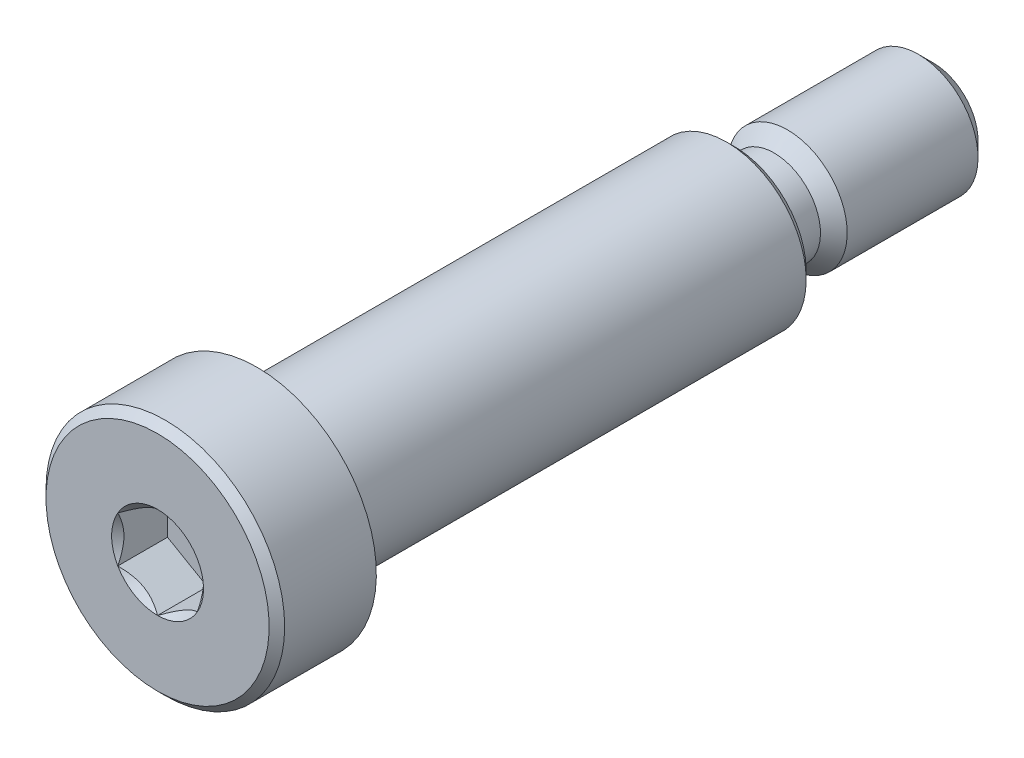
ISO-10303-21;
HEADER;
FILE_DESCRIPTION(('STEP AP214'),'2;1');
FILE_NAME('part.step','',(''),(''),'','','');
FILE_SCHEMA(('AUTOMOTIVE_DESIGN { 1 0 10303 214 1 1 1 1 }'));
ENDSEC;
DATA;
#1=APPLICATION_CONTEXT('core data for automotive mechanical design processes');
#2=APPLICATION_PROTOCOL_DEFINITION('international standard','automotive_design',2000,#1);
#3=PRODUCT_CONTEXT('',#1,'mechanical');
#4=PRODUCT('Part','Part','',(#3));
#5=PRODUCT_RELATED_PRODUCT_CATEGORY('part','',(#4));
#6=PRODUCT_DEFINITION_FORMATION('','',#4);
#7=PRODUCT_DEFINITION_CONTEXT('part definition',#1,'design');
#8=PRODUCT_DEFINITION('design','',#6,#7);
#9=PRODUCT_DEFINITION_SHAPE('','',#8);
#10=(LENGTH_UNIT() NAMED_UNIT(*) SI_UNIT(.MILLI.,.METRE.));
#11=(NAMED_UNIT(*) PLANE_ANGLE_UNIT() SI_UNIT($,.RADIAN.));
#12=(NAMED_UNIT(*) SI_UNIT($,.STERADIAN.) SOLID_ANGLE_UNIT());
#13=UNCERTAINTY_MEASURE_WITH_UNIT(LENGTH_MEASURE(1.E-05),#10,'distance_accuracy_value','');
#14=(GEOMETRIC_REPRESENTATION_CONTEXT(3) GLOBAL_UNCERTAINTY_ASSIGNED_CONTEXT((#13)) GLOBAL_UNIT_ASSIGNED_CONTEXT((#10,
#11,#12)) REPRESENTATION_CONTEXT('',''));
#15=CARTESIAN_POINT('',(0.,0.,0.));
#16=DIRECTION('',(0.,0.,1.));
#17=DIRECTION('',(1.,0.,0.));
#18=AXIS2_PLACEMENT_3D('',#15,#16,#17);
#19=CARTESIAN_POINT('',(0.,0.,0.));
#20=DIRECTION('',(0.,0.,1.));
#21=DIRECTION('',(0.,-1.,0.));
#22=AXIS2_PLACEMENT_3D('',#19,#20,#21);
#23=PLANE('',#22);
#24=CARTESIAN_POINT('',(0.,0.,0.));
#25=DIRECTION('',(0.,0.,1.));
#26=DIRECTION('',(1.,0.,0.));
#27=AXIS2_PLACEMENT_3D('',#24,#25,#26);
#28=CIRCLE('',#27,3.66617420935412);
#29=CARTESIAN_POINT('',(0.,-3.66617420935412,0.));
#30=VERTEX_POINT('',#29);
#31=CARTESIAN_POINT('',(3.175,-1.83308710467707,0.));
#32=VERTEX_POINT('',#31);
#33=EDGE_CURVE('E61',#30,#32,#28,.T.);
#34=ORIENTED_EDGE('',*,*,#33,.F.);
#35=CARTESIAN_POINT('',(-3.175,-1.83308710467706,0.));
#36=VERTEX_POINT('',#35);
#37=EDGE_CURVE('E68',#36,#30,#28,.T.);
#38=ORIENTED_EDGE('',*,*,#37,.F.);
#39=CARTESIAN_POINT('',(-3.175,1.83308710467706,0.));
#40=VERTEX_POINT('',#39);
#41=EDGE_CURVE('E141',#40,#36,#28,.T.);
#42=ORIENTED_EDGE('',*,*,#41,.F.);
#43=CARTESIAN_POINT('',(0.,3.66617420935412,0.));
#44=VERTEX_POINT('',#43);
#45=EDGE_CURVE('E136',#44,#40,#28,.T.);
#46=ORIENTED_EDGE('',*,*,#45,.F.);
#47=CARTESIAN_POINT('',(3.175,1.83308710467706,0.));
#48=VERTEX_POINT('',#47);
#49=EDGE_CURVE('E109',#48,#44,#28,.T.);
#50=ORIENTED_EDGE('',*,*,#49,.F.);
#51=EDGE_CURVE('E100',#32,#48,#28,.T.);
#52=ORIENTED_EDGE('',*,*,#51,.F.);
#53=EDGE_LOOP('',(#34,#38,#42,#46,#50,#52));
#54=FACE_BOUND('',#53,.T.);
#55=CARTESIAN_POINT('',(0.,0.,0.));
#56=DIRECTION('',(0.,0.,1.));
#57=DIRECTION('',(0.,-1.,0.));
#58=AXIS2_PLACEMENT_3D('',#55,#56,#57);
#59=CIRCLE('',#58,8.90587499999999);
#60=CARTESIAN_POINT('',(0.,-8.90587499999999,0.));
#61=VERTEX_POINT('',#60);
#62=EDGE_CURVE('E55',#61,#61,#59,.T.);
#63=ORIENTED_EDGE('',*,*,#62,.T.);
#64=EDGE_LOOP('',(#63));
#65=FACE_BOUND('',#64,.T.);
#66=ADVANCED_FACE('F41',(#54,#65),#23,.T.);
#67=CARTESIAN_POINT('',(0.,0.,-61.9125));
#68=DIRECTION('',(0.,0.,-1.));
#69=DIRECTION('',(0.,1.,0.));
#70=AXIS2_PLACEMENT_3D('',#67,#68,#69);
#71=CYLINDRICAL_SURFACE('',#70,9.525);
#72=CARTESIAN_POINT('',(0.,0.,-0.619125000000019));
#73=DIRECTION('',(0.,0.,1.));
#74=DIRECTION('',(0.,-1.,0.));
#75=AXIS2_PLACEMENT_3D('',#72,#73,#74);
#76=CIRCLE('',#75,9.525);
#77=CARTESIAN_POINT('',(0.,-9.525,-0.619125000000019));
#78=VERTEX_POINT('',#77);
#79=EDGE_CURVE('E236',#78,#78,#76,.F.);
#80=ORIENTED_EDGE('',*,*,#79,.T.);
#81=EDGE_LOOP('',(#80));
#82=FACE_BOUND('',#81,.T.);
#83=CARTESIAN_POINT('',(0.,0.,-7.93750000000001));
#84=DIRECTION('',(0.,0.,-1.));
#85=DIRECTION('',(0.,1.,0.));
#86=AXIS2_PLACEMENT_3D('',#83,#84,#85);
#87=CIRCLE('',#86,9.525);
#88=CARTESIAN_POINT('',(0.,9.525,-7.93750000000001));
#89=VERTEX_POINT('',#88);
#90=EDGE_CURVE('E251',#89,#89,#87,.T.);
#91=ORIENTED_EDGE('',*,*,#90,.F.);
#92=EDGE_LOOP('',(#91));
#93=FACE_BOUND('',#92,.T.);
#94=ADVANCED_FACE('F202',(#82,#93),#71,.T.);
#95=CARTESIAN_POINT('',(0.,-9.525,-7.93750000000001));
#96=DIRECTION('',(0.,0.,-1.));
#97=DIRECTION('',(0.,1.,0.));
#98=AXIS2_PLACEMENT_3D('',#95,#96,#97);
#99=PLANE('',#98);
#100=ORIENTED_EDGE('',*,*,#90,.T.);
#101=EDGE_LOOP('',(#100));
#102=FACE_BOUND('',#101,.T.);
#103=CARTESIAN_POINT('',(0.,0.,-7.93750000000001));
#104=DIRECTION('',(0.,0.,-1.));
#105=DIRECTION('',(0.,1.,0.));
#106=AXIS2_PLACEMENT_3D('',#103,#104,#105);
#107=CIRCLE('',#106,6.34999999999999);
#108=CARTESIAN_POINT('',(0.,6.34999999999999,-7.93750000000001));
#109=VERTEX_POINT('',#108);
#110=EDGE_CURVE('E253',#109,#109,#107,.T.);
#111=ORIENTED_EDGE('',*,*,#110,.F.);
#112=EDGE_LOOP('',(#111));
#113=FACE_BOUND('',#112,.T.);
#114=ADVANCED_FACE('F209',(#102,#113),#99,.T.);
#115=CARTESIAN_POINT('',(0.,0.,-61.9125));
#116=DIRECTION('',(0.,0.,-1.));
#117=DIRECTION('',(0.,1.,0.));
#118=AXIS2_PLACEMENT_3D('',#115,#116,#117);
#119=CYLINDRICAL_SURFACE('',#118,6.35);
#120=CARTESIAN_POINT('',(0.,0.,-45.418375));
#121=DIRECTION('',(0.,0.,-1.));
#122=DIRECTION('',(0.,1.,0.));
#123=AXIS2_PLACEMENT_3D('',#120,#121,#122);
#124=CIRCLE('',#123,6.35);
#125=CARTESIAN_POINT('',(0.,-6.34999999999999,-45.418375));
#126=VERTEX_POINT('',#125);
#127=EDGE_CURVE('E229',#126,#126,#124,.F.);
#128=ORIENTED_EDGE('',*,*,#127,.T.);
#129=EDGE_LOOP('',(#128));
#130=FACE_BOUND('',#129,.T.);
#131=ORIENTED_EDGE('',*,*,#110,.T.);
#132=EDGE_LOOP('',(#131));
#133=FACE_BOUND('',#132,.T.);
#134=ADVANCED_FACE('F418',(#130,#133),#119,.T.);
#135=CARTESIAN_POINT('',(0.,-6.35,-46.0375));
#136=DIRECTION('',(0.,0.,-1.));
#137=DIRECTION('',(0.,1.,0.));
#138=AXIS2_PLACEMENT_3D('',#135,#136,#137);
#139=PLANE('',#138);
#140=CARTESIAN_POINT('',(0.,0.,-46.0375));
#141=DIRECTION('',(0.,0.,-1.));
#142=DIRECTION('',(0.,1.,0.));
#143=AXIS2_PLACEMENT_3D('',#140,#141,#142);
#144=CIRCLE('',#143,5.73087499999999);
#145=CARTESIAN_POINT('',(0.,-5.73087499999998,-46.0375));
#146=VERTEX_POINT('',#145);
#147=EDGE_CURVE('E232',#146,#146,#144,.T.);
#148=ORIENTED_EDGE('',*,*,#147,.T.);
#149=EDGE_LOOP('',(#148));
#150=FACE_BOUND('',#149,.T.);
#151=CARTESIAN_POINT('',(0.,0.,-46.0375));
#152=DIRECTION('',(0.,0.,-1.));
#153=DIRECTION('',(0.,1.,0.));
#154=AXIS2_PLACEMENT_3D('',#151,#152,#153);
#155=CIRCLE('',#154,4.7625);
#156=CARTESIAN_POINT('',(0.,4.7625,-46.0375));
#157=VERTEX_POINT('',#156);
#158=EDGE_CURVE('E262',#157,#157,#155,.T.);
#159=ORIENTED_EDGE('',*,*,#158,.F.);
#160=EDGE_LOOP('',(#159));
#161=FACE_BOUND('',#160,.T.);
#162=ADVANCED_FACE('F398',(#150,#161),#139,.T.);
#163=CARTESIAN_POINT('',(0.,0.,-47.1043));
#164=DIRECTION('',(0.,0.,-1.));
#165=DIRECTION('',(0.,1.,0.));
#166=AXIS2_PLACEMENT_3D('',#163,#164,#165);
#167=TOROIDAL_SURFACE('',#166,4.7625,1.0668);
#168=CARTESIAN_POINT('',(0.,0.,-47.1043));
#169=DIRECTION('',(0.,0.,-1.));
#170=DIRECTION('',(0.,1.,0.));
#171=AXIS2_PLACEMENT_3D('',#168,#169,#170);
#172=CIRCLE('',#171,3.6957);
#173=CARTESIAN_POINT('',(0.,3.6957,-47.1043));
#174=VERTEX_POINT('',#173);
#175=EDGE_CURVE('E266',#174,#174,#172,.T.);
#176=ORIENTED_EDGE('',*,*,#175,.F.);
#177=EDGE_LOOP('',(#176));
#178=FACE_BOUND('',#177,.T.);
#179=ORIENTED_EDGE('',*,*,#158,.T.);
#180=EDGE_LOOP('',(#179));
#181=FACE_BOUND('',#180,.T.);
#182=ADVANCED_FACE('F390',(#178,#181),#167,.F.);
#183=CARTESIAN_POINT('',(0.,0.,-61.9125));
#184=DIRECTION('',(0.,0.,-1.));
#185=DIRECTION('',(0.,1.,0.));
#186=AXIS2_PLACEMENT_3D('',#183,#184,#185);
#187=CYLINDRICAL_SURFACE('',#186,3.6957);
#188=CARTESIAN_POINT('',(0.,0.,-49.2125));
#189=DIRECTION('',(0.,0.,-1.));
#190=DIRECTION('',(0.,1.,0.));
#191=AXIS2_PLACEMENT_3D('',#188,#189,#190);
#192=CIRCLE('',#191,3.6957);
#193=CARTESIAN_POINT('',(0.,3.6957,-49.2125));
#194=VERTEX_POINT('',#193);
#195=EDGE_CURVE('E270',#194,#194,#192,.T.);
#196=ORIENTED_EDGE('',*,*,#195,.F.);
#197=EDGE_LOOP('',(#196));
#198=FACE_BOUND('',#197,.T.);
#199=ORIENTED_EDGE('',*,*,#175,.T.);
#200=EDGE_LOOP('',(#199));
#201=FACE_BOUND('',#200,.T.);
#202=ADVANCED_FACE('F382',(#198,#201),#187,.T.);
#203=CARTESIAN_POINT('',(0.,0.,-49.2125));
#204=DIRECTION('',(0.,0.,-1.));
#205=DIRECTION('',(0.,1.,0.));
#206=AXIS2_PLACEMENT_3D('',#203,#204,#205);
#207=CONICAL_SURFACE('',#206,3.6957,0.785398163397443);
#208=CARTESIAN_POINT('',(0.,0.,-50.2793));
#209=DIRECTION('',(0.,0.,-1.));
#210=DIRECTION('',(0.,1.,0.));
#211=AXIS2_PLACEMENT_3D('',#208,#209,#210);
#212=CIRCLE('',#211,4.7625);
#213=CARTESIAN_POINT('',(0.,4.7625,-50.2793));
#214=VERTEX_POINT('',#213);
#215=EDGE_CURVE('E257',#214,#214,#212,.F.);
#216=ORIENTED_EDGE('',*,*,#215,.T.);
#217=EDGE_LOOP('',(#216));
#218=FACE_BOUND('',#217,.T.);
#219=ORIENTED_EDGE('',*,*,#195,.T.);
#220=EDGE_LOOP('',(#219));
#221=FACE_BOUND('',#220,.T.);
#222=ADVANCED_FACE('F376',(#218,#221),#207,.T.);
#223=CARTESIAN_POINT('',(0.,-4.7625,-61.9125));
#224=DIRECTION('',(0.,0.,-1.));
#225=DIRECTION('',(0.,1.,0.));
#226=AXIS2_PLACEMENT_3D('',#223,#224,#225);
#227=PLANE('',#226);
#228=CARTESIAN_POINT('',(0.,0.,-61.9125));
#229=DIRECTION('',(0.,0.,-1.));
#230=DIRECTION('',(0.,1.,0.));
#231=AXIS2_PLACEMENT_3D('',#228,#229,#230);
#232=CIRCLE('',#231,3.57187500000002);
#233=CARTESIAN_POINT('',(0.,3.57187500000002,-61.9125));
#234=VERTEX_POINT('',#233);
#235=EDGE_CURVE('E239',#234,#234,#232,.T.);
#236=ORIENTED_EDGE('',*,*,#235,.T.);
#237=EDGE_LOOP('',(#236));
#238=FACE_BOUND('',#237,.T.);
#239=ADVANCED_FACE('F381',(#238),#227,.T.);
#240=CARTESIAN_POINT('',(0.,0.,-61.9125));
#241=DIRECTION('',(0.,0.,-1.));
#242=DIRECTION('',(0.,1.,0.));
#243=AXIS2_PLACEMENT_3D('',#240,#241,#242);
#244=CYLINDRICAL_SURFACE('',#243,4.7625);
#245=CARTESIAN_POINT('',(0.,0.,-60.721875));
#246=DIRECTION('',(0.,0.,-1.));
#247=DIRECTION('',(0.,1.,0.));
#248=AXIS2_PLACEMENT_3D('',#245,#246,#247);
#249=CIRCLE('',#248,4.7625);
#250=CARTESIAN_POINT('',(0.,4.7625,-60.721875));
#251=VERTEX_POINT('',#250);
#252=EDGE_CURVE('E234',#251,#251,#249,.F.);
#253=ORIENTED_EDGE('',*,*,#252,.T.);
#254=EDGE_LOOP('',(#253));
#255=FACE_BOUND('',#254,.T.);
#256=ORIENTED_EDGE('',*,*,#215,.F.);
#257=EDGE_LOOP('',(#256));
#258=FACE_BOUND('',#257,.T.);
#259=ADVANCED_FACE('F217',(#255,#258),#244,.T.);
#260=CARTESIAN_POINT('',(0.,0.,-61.9125));
#261=DIRECTION('',(0.,0.,1.));
#262=DIRECTION('',(0.,-1.,0.));
#263=AXIS2_PLACEMENT_3D('',#260,#261,#262);
#264=CONICAL_SURFACE('',#263,3.57187500000002,0.785398163397442);
#265=ORIENTED_EDGE('',*,*,#252,.F.);
#266=EDGE_LOOP('',(#265));
#267=FACE_BOUND('',#266,.T.);
#268=ORIENTED_EDGE('',*,*,#235,.F.);
#269=EDGE_LOOP('',(#268));
#270=FACE_BOUND('',#269,.T.);
#271=ADVANCED_FACE('F214',(#267,#270),#264,.T.);
#272=CARTESIAN_POINT('',(0.,0.,-46.0375));
#273=DIRECTION('',(0.,0.,1.));
#274=DIRECTION('',(0.,-1.,0.));
#275=AXIS2_PLACEMENT_3D('',#272,#273,#274);
#276=CONICAL_SURFACE('',#275,5.73087499999999,0.78539816339745);
#277=CARTESIAN_POINT('',(0.,-6.34999999999999,-45.418375));
#278=CARTESIAN_POINT('',(0.,-6.34355078124999,-45.42482421875));
#279=CARTESIAN_POINT('',(0.,-6.33710156249999,-45.4312734375));
#280=CARTESIAN_POINT('',(0.,-6.32420312499999,-45.444171875));
#281=CARTESIAN_POINT('',(0.,-6.31775390624999,-45.45062109375));
#282=CARTESIAN_POINT('',(0.,-6.30485546874999,-45.46351953125));
#283=CARTESIAN_POINT('',(0.,-6.29840624999999,-45.46996875));
#284=CARTESIAN_POINT('',(0.,-6.28550781249999,-45.4828671875));
#285=CARTESIAN_POINT('',(0.,-6.27905859374999,-45.48931640625));
#286=CARTESIAN_POINT('',(0.,-6.26616015624999,-45.50221484375));
#287=CARTESIAN_POINT('',(0.,-6.25971093749999,-45.5086640625));
#288=CARTESIAN_POINT('',(0.,-6.24681249999999,-45.5215625));
#289=CARTESIAN_POINT('',(0.,-6.24036328124999,-45.52801171875));
#290=CARTESIAN_POINT('',(0.,-6.22746484374999,-45.54091015625));
#291=CARTESIAN_POINT('',(0.,-6.22101562499999,-45.547359375));
#292=CARTESIAN_POINT('',(0.,-6.20811718749999,-45.5602578125));
#293=CARTESIAN_POINT('',(0.,-6.20166796874999,-45.56670703125));
#294=CARTESIAN_POINT('',(0.,-6.18876953124999,-45.57960546875));
#295=CARTESIAN_POINT('',(0.,-6.18232031249999,-45.5860546875));
#296=CARTESIAN_POINT('',(0.,-6.16942187499999,-45.598953125));
#297=CARTESIAN_POINT('',(0.,-6.16297265624999,-45.60540234375));
#298=CARTESIAN_POINT('',(0.,-6.15007421874999,-45.61830078125));
#299=CARTESIAN_POINT('',(0.,-6.14362499999999,-45.62475));
#300=CARTESIAN_POINT('',(0.,-6.13072656249999,-45.6376484375));
#301=CARTESIAN_POINT('',(0.,-6.12427734374999,-45.64409765625));
#302=CARTESIAN_POINT('',(0.,-6.11137890624999,-45.65699609375));
#303=CARTESIAN_POINT('',(0.,-6.10492968749999,-45.6634453125));
#304=CARTESIAN_POINT('',(0.,-6.09203124999999,-45.67634375));
#305=CARTESIAN_POINT('',(0.,-6.08558203124999,-45.68279296875));
#306=CARTESIAN_POINT('',(0.,-6.07268359374999,-45.69569140625));
#307=CARTESIAN_POINT('',(0.,-6.06623437499999,-45.702140625));
#308=CARTESIAN_POINT('',(0.,-6.05333593749999,-45.7150390625));
#309=CARTESIAN_POINT('',(0.,-6.04688671874999,-45.72148828125));
#310=CARTESIAN_POINT('',(0.,-6.03398828124999,-45.73438671875));
#311=CARTESIAN_POINT('',(0.,-6.02753906249999,-45.7408359375));
#312=CARTESIAN_POINT('',(0.,-6.01464062499999,-45.753734375));
#313=CARTESIAN_POINT('',(0.,-6.00819140624999,-45.76018359375));
#314=CARTESIAN_POINT('',(0.,-5.99529296874999,-45.77308203125));
#315=CARTESIAN_POINT('',(0.,-5.98884374999998,-45.77953125));
#316=CARTESIAN_POINT('',(0.,-5.97594531249998,-45.7924296875));
#317=CARTESIAN_POINT('',(0.,-5.96949609374999,-45.79887890625));
#318=CARTESIAN_POINT('',(0.,-5.95659765624999,-45.81177734375));
#319=CARTESIAN_POINT('',(0.,-5.95014843749999,-45.8182265625));
#320=CARTESIAN_POINT('',(0.,-5.93724999999999,-45.831125));
#321=CARTESIAN_POINT('',(0.,-5.93080078124999,-45.83757421875));
#322=CARTESIAN_POINT('',(0.,-5.91790234374998,-45.85047265625));
#323=CARTESIAN_POINT('',(0.,-5.91145312499998,-45.856921875));
#324=CARTESIAN_POINT('',(0.,-5.89855468749998,-45.8698203125));
#325=CARTESIAN_POINT('',(0.,-5.89210546874998,-45.87626953125));
#326=CARTESIAN_POINT('',(0.,-5.87920703124998,-45.88916796875));
#327=CARTESIAN_POINT('',(0.,-5.87275781249998,-45.8956171875));
#328=CARTESIAN_POINT('',(0.,-5.85985937499998,-45.908515625));
#329=CARTESIAN_POINT('',(0.,-5.85341015624998,-45.91496484375));
#330=CARTESIAN_POINT('',(0.,-5.84051171874998,-45.92786328125));
#331=CARTESIAN_POINT('',(0.,-5.83406249999998,-45.9343125));
#332=CARTESIAN_POINT('',(0.,-5.82116406249998,-45.9472109375));
#333=CARTESIAN_POINT('',(0.,-5.81471484374998,-45.95366015625));
#334=CARTESIAN_POINT('',(0.,-5.80181640624998,-45.96655859375));
#335=CARTESIAN_POINT('',(0.,-5.79536718749998,-45.9730078125));
#336=CARTESIAN_POINT('',(0.,-5.78246874999998,-45.98590625));
#337=CARTESIAN_POINT('',(0.,-5.77601953124998,-45.99235546875));
#338=CARTESIAN_POINT('',(0.,-5.76312109374998,-46.00525390625));
#339=CARTESIAN_POINT('',(0.,-5.75667187499998,-46.011703125));
#340=CARTESIAN_POINT('',(0.,-5.74377343749998,-46.0246015625));
#341=CARTESIAN_POINT('',(0.,-5.73732421874998,-46.03105078125));
#342=CARTESIAN_POINT('',(0.,-5.73087499999998,-46.0375));
#343=B_SPLINE_CURVE_WITH_KNOTS('',3,(#277,#278,#279,#280,#281,#282,#283,#284,#285,#286,#287,
#288,#289,#290,#291,#292,#293,#294,#295,#296,#297,#298,#299,#300,#301,#302,#303,#304,#305,#306,
#307,#308,#309,#310,#311,#312,#313,#314,#315,#316,#317,#318,#319,#320,#321,#322,#323,#324,#325,
#326,#327,#328,#329,#330,#331,#332,#333,#334,#335,#336,#337,#338,#339,#340,#341,#342),
.UNSPECIFIED.,.F.,.F.,(4,2,2,2,2,2,2,2,2,2,2,2,2,2,2,2,2,2,2,2,2,2,2,2,2,2,2,2,2,2,2,2,4),(0.,
0.0273617178688837,0.0547234357377674,0.0820851536066518,0.109446871475536,0.136808589344414,
0.164170307213299,0.191532025082182,0.218893742951066,0.24625546081995,0.273617178688829,
0.300978896557713,0.328340614426597,0.355702332295481,0.38306405016436,0.410425768033244,
0.437787485902128,0.465149203771012,0.492510921639895,0.519872639508775,0.547234357377659,
0.574596075246542,0.601957793115427,0.629319510984305,0.656681228853189,0.684042946722074,
0.711404664590957,0.738766382459841,0.76612810032872,0.793489818197604,0.820851536066488,
0.848213253935372,0.875574971804251),.UNSPECIFIED.);
#344=EDGE_CURVE('BSEAM216',#126,#146,#343,.T.);
#345=ORIENTED_EDGE('',*,*,#127,.F.);
#346=ORIENTED_EDGE('',*,*,#147,.F.);
#347=ORIENTED_EDGE('',*,*,#344,.T.);
#348=ORIENTED_EDGE('',*,*,#344,.F.);
#349=EDGE_LOOP('',(#345,#347,#346,#348));
#350=FACE_BOUND('',#349,.T.);
#351=ADVANCED_FACE('F216',(#350),#276,.T.);
#352=CARTESIAN_POINT('',(0.,0.,-0.619125000000019));
#353=DIRECTION('',(0.,0.,-1.));
#354=DIRECTION('',(0.,1.,0.));
#355=AXIS2_PLACEMENT_3D('',#352,#353,#354);
#356=CONICAL_SURFACE('',#355,9.525,0.785398163397443);
#357=ORIENTED_EDGE('',*,*,#62,.F.);
#358=EDGE_LOOP('',(#357));
#359=FACE_BOUND('',#358,.T.);
#360=ORIENTED_EDGE('',*,*,#79,.F.);
#361=EDGE_LOOP('',(#360));
#362=FACE_BOUND('',#361,.T.);
#363=ADVANCED_FACE('F43',(#359,#362),#356,.T.);
#364=CARTESIAN_POINT('',(0.,0.,0.));
#365=DIRECTION('',(0.,0.,1.));
#366=DIRECTION('',(1.,0.,0.));
#367=AXIS2_PLACEMENT_3D('',#364,#365,#366);
#368=CONICAL_SURFACE('',#367,3.66617420935412,0.78539816339745);
#369=ORIENTED_EDGE('',*,*,#49,.T.);
#370=CARTESIAN_POINT('',(3.1752,1.83297163462322,0.000115475508944067));
#371=CARTESIAN_POINT('',(3.06606165005017,1.89598269034567,-0.0628410163082169));
#372=CARTESIAN_POINT('',(2.95509837192206,1.9600473688431,-0.122099895765255));
#373=CARTESIAN_POINT('',(2.72883215365405,2.09068223086865,-0.230601344269443));
#374=CARTESIAN_POINT('',(2.61350769674774,2.15726483710766,-0.279783546061288));
#375=CARTESIAN_POINT('',(2.38096147751938,2.29152545937818,-0.364033541125997));
#376=CARTESIAN_POINT('',(2.26379893371885,2.35916928558036,-0.399313085500551));
#377=CARTESIAN_POINT('',(2.02689455535372,2.49594609220167,-0.45366842986518));
#378=CARTESIAN_POINT('',(1.90715995735645,2.5650748945867,-0.47278480247036));
#379=CARTESIAN_POINT('',(1.70080208124842,2.68421566990707,-0.490032869376752));
#380=CARTESIAN_POINT('',(1.61444529227085,2.73407378526963,-0.492586066386179));
#381=CARTESIAN_POINT('',(1.44187218347529,2.83370891608763,-0.488283726876735));
#382=CARTESIAN_POINT('',(1.3556559235072,2.88348589698873,-0.481424891978556));
#383=CARTESIAN_POINT('',(1.18404020841287,2.98256827629561,-0.4586901166963));
#384=CARTESIAN_POINT('',(1.09864177574673,3.03187308438378,-0.442804090312722));
#385=CARTESIAN_POINT('',(0.929311596694528,3.1296359088415,-0.402882016002049));
#386=CARTESIAN_POINT('',(0.845379738380253,3.17809398983283,-0.37884659291483));
#387=CARTESIAN_POINT('',(0.696376420715886,3.2641210953965,-0.329394765582835));
#388=CARTESIAN_POINT('',(0.630975148808269,3.30188053733771,-0.305278280699013));
#389=CARTESIAN_POINT('',(0.501346749794894,3.3767215284027,-0.253158532862845));
#390=CARTESIAN_POINT('',(0.437119658558277,3.41380305681743,-0.225155151396475));
#391=CARTESIAN_POINT('',(0.3100419654874,3.48717139711989,-0.165889434455491));
#392=CARTESIAN_POINT('',(0.247187749251276,3.52346029578352,-0.134637346645791));
#393=CARTESIAN_POINT('',(0.122643379151907,3.59536602138644,-0.0692846556080675));
#394=CARTESIAN_POINT('',(0.0609525390212909,3.63098324454239,-0.0351858004814551));
#395=CARTESIAN_POINT('',(-0.000199999999999575,3.66628967940796,0.000115475508943787));
#396=B_SPLINE_CURVE_WITH_KNOTS('',3,(#370,#371,#372,#373,#374,#375,#376,#377,#378,#379,#380,
#381,#382,#383,#384,#385,#386,#387,#388,#389,#390,#391,#392,#393,#394,#395),.UNSPECIFIED.,.F.,
.F.,(4,2,2,2,2,2,2,2,2,2,2,2,4),(0.,0.422910572436808,0.848285055427807,1.26690402276127,
1.68446903107506,1.98329272958351,2.2822211754689,2.58148426995465,2.88072442418452,
3.11844134429546,3.35616551414405,3.59316134346767,3.8300126974443),.UNSPECIFIED.);
#397=EDGE_CURVE('E11',#48,#44,#396,.T.);
#398=ORIENTED_EDGE('',*,*,#397,.F.);
#399=EDGE_LOOP('',(#369,#398));
#400=FACE_BOUND('',#399,.T.);
#401=ADVANCED_FACE('F112',(#400),#368,.F.);
#402=ORIENTED_EDGE('',*,*,#45,.T.);
#403=CARTESIAN_POINT('',(0.000200000000000467,3.66628967940796,0.000115475508943935));
#404=CARTESIAN_POINT('',(-0.108938349949825,3.60327862368552,-0.0628410163082174));
#405=CARTESIAN_POINT('',(-0.219901628077944,3.53921394518809,-0.122099895765256));
#406=CARTESIAN_POINT('',(-0.446167846345946,3.40857908316254,-0.230601344269443));
#407=CARTESIAN_POINT('',(-0.561492303252261,3.34199647692353,-0.279783546061287));
#408=CARTESIAN_POINT('',(-0.794038522480624,3.207735854653,-0.364033541125996));
#409=CARTESIAN_POINT('',(-0.911201066281148,3.14009202845083,-0.39931308550055));
#410=CARTESIAN_POINT('',(-1.14810544464628,3.00331522182952,-0.453668429865179));
#411=CARTESIAN_POINT('',(-1.26784004264355,2.93418641944448,-0.47278480247036));
#412=CARTESIAN_POINT('',(-1.47419791875158,2.81504564412411,-0.490032869376752));
#413=CARTESIAN_POINT('',(-1.56055470772915,2.76518752876156,-0.492586066386179));
#414=CARTESIAN_POINT('',(-1.73312781652471,2.66555239794355,-0.488283726876735));
#415=CARTESIAN_POINT('',(-1.8193440764928,2.61577541704245,-0.481424891978555));
#416=CARTESIAN_POINT('',(-1.99095979158713,2.51669303773558,-0.458690116696299));
#417=CARTESIAN_POINT('',(-2.07635822425327,2.4673882296474,-0.442804090312722));
#418=CARTESIAN_POINT('',(-2.24568840330547,2.36962540518969,-0.402882016002048));
#419=CARTESIAN_POINT('',(-2.32962026161975,2.32116732419836,-0.37884659291483));
#420=CARTESIAN_POINT('',(-2.47862357928411,2.23514021863469,-0.329394765582835));
#421=CARTESIAN_POINT('',(-2.54402485119173,2.19738077669348,-0.305278280699012));
#422=CARTESIAN_POINT('',(-2.67365325020511,2.12253978562849,-0.253158532862845));
#423=CARTESIAN_POINT('',(-2.73788034144172,2.08545825721376,-0.225155151396475));
#424=CARTESIAN_POINT('',(-2.8649580345126,2.01208991691129,-0.165889434455491));
#425=CARTESIAN_POINT('',(-2.92781225074872,1.97580101824767,-0.134637346645791));
#426=CARTESIAN_POINT('',(-3.05235662084809,1.90389529264474,-0.0692846556080678));
#427=CARTESIAN_POINT('',(-3.11404746097871,1.8682780694888,-0.0351858004814554));
#428=CARTESIAN_POINT('',(-3.1752,1.83297163462323,0.000115475508943606));
#429=B_SPLINE_CURVE_WITH_KNOTS('',3,(#403,#404,#405,#406,#407,#408,#409,#410,#411,#412,#413,
#414,#415,#416,#417,#418,#419,#420,#421,#422,#423,#424,#425,#426,#427,#428),.UNSPECIFIED.,.F.,
.F.,(4,2,2,2,2,2,2,2,2,2,2,2,4),(0.,0.422910572436808,0.848285055427807,1.26690402276127,
1.68446903107506,1.98329272958351,2.2822211754689,2.58148426995465,2.88072442418451,
3.11844134429546,3.35616551414405,3.59316134346766,3.8300126974443),.UNSPECIFIED.);
#430=EDGE_CURVE('E137',#44,#40,#429,.T.);
#431=ORIENTED_EDGE('',*,*,#430,.F.);
#432=EDGE_LOOP('',(#402,#431));
#433=FACE_BOUND('',#432,.T.);
#434=ADVANCED_FACE('F307',(#433),#368,.F.);
#435=ORIENTED_EDGE('',*,*,#41,.T.);
#436=CARTESIAN_POINT('',(-3.175,-3.65592387452516,1.17597452610651));
#437=CARTESIAN_POINT('',(-3.175,-3.56690614739902,1.10877955728795));
#438=CARTESIAN_POINT('',(-3.175,-3.47739001482927,1.04223411677949));
#439=CARTESIAN_POINT('',(-3.175,-3.29716433407819,0.910733107989));
#440=CARTESIAN_POINT('',(-3.175,-3.20645449195236,0.8457779430093));
#441=CARTESIAN_POINT('',(-3.175,-3.02298124672425,0.717286472588262));
#442=CARTESIAN_POINT('',(-3.175,-2.93020737789476,0.653765060519482));
#443=CARTESIAN_POINT('',(-3.175,-2.74308490461527,0.529093231239513));
#444=CARTESIAN_POINT('',(-3.175,-2.64873641209623,0.467942646518007));
#445=CARTESIAN_POINT('',(-3.175,-2.45276910629102,0.345127291468585));
#446=CARTESIAN_POINT('',(-3.175,-2.35104296923552,0.283632900035067));
#447=CARTESIAN_POINT('',(-3.175,-2.14521620329061,0.164690024110211));
#448=CARTESIAN_POINT('',(-3.175,-2.04111520164361,0.107242180628362));
#449=CARTESIAN_POINT('',(-3.175,-1.8305483898592,-0.00236807378855735));
#450=CARTESIAN_POINT('',(-3.175,-1.72409073387149,-0.05454602658689));
#451=CARTESIAN_POINT('',(-3.175,-1.50827203793058,-0.152448430174923));
#452=CARTESIAN_POINT('',(-3.175,-1.39891233941784,-0.198175803007057));
#453=CARTESIAN_POINT('',(-3.175,-1.18604701054559,-0.278193824629251));
#454=CARTESIAN_POINT('',(-3.175,-1.08277848917347,-0.313108695034414));
#455=CARTESIAN_POINT('',(-3.175,-0.873755153890324,-0.374653665073786));
#456=CARTESIAN_POINT('',(-3.175,-0.768000169236097,-0.401283193963396));
#457=CARTESIAN_POINT('',(-3.175,-0.556394353071963,-0.444423804951883));
#458=CARTESIAN_POINT('',(-3.175,-0.450579451492892,-0.461108250420231));
#459=CARTESIAN_POINT('',(-3.175,-0.237818454981045,-0.484034858218018));
#460=CARTESIAN_POINT('',(-3.175,-0.130872557680108,-0.49027881555587));
#461=CARTESIAN_POINT('',(-3.175,0.0792250150830045,-0.491860727197653));
#462=CARTESIAN_POINT('',(-3.175,0.18237391199382,-0.487585251998013));
#463=CARTESIAN_POINT('',(-3.175,0.387788153537299,-0.469217325011947));
#464=CARTESIAN_POINT('',(-3.175,0.490053411359905,-0.455123919552885));
#465=CARTESIAN_POINT('',(-3.175,0.694689208906974,-0.417649304806497));
#466=CARTESIAN_POINT('',(-3.175,0.797030337701614,-0.394110040645698));
#467=CARTESIAN_POINT('',(-3.175,0.999482692253839,-0.3389990990408));
#468=CARTESIAN_POINT('',(-3.175,1.09959410383402,-0.307428093699382));
#469=CARTESIAN_POINT('',(-3.175,1.30666025401972,-0.234302973381313));
#470=CARTESIAN_POINT('',(-3.175,1.41338058113121,-0.192091761298271));
#471=CARTESIAN_POINT('',(-3.175,1.62403512608011,-0.101194633675295));
#472=CARTESIAN_POINT('',(-3.175,1.72796839622315,-0.0525065484982067));
#473=CARTESIAN_POINT('',(-3.175,1.93357808805447,0.0501937756761229));
#474=CARTESIAN_POINT('',(-3.175,2.03524592560239,0.104223062169345));
#475=CARTESIAN_POINT('',(-3.175,2.23624195707291,0.216408901364748));
#476=CARTESIAN_POINT('',(-3.175,2.3355705197654,0.274564797656881));
#477=CARTESIAN_POINT('',(-3.175,2.52730642275902,0.391215115503931));
#478=CARTESIAN_POINT('',(-3.175,2.61981218330511,0.449548619193316));
#479=CARTESIAN_POINT('',(-3.175,2.80323560367684,0.568668649469825));
#480=CARTESIAN_POINT('',(-3.175,2.89415314246283,0.629455361859399));
#481=CARTESIAN_POINT('',(-3.175,3.07387072487129,0.752541216482857));
#482=CARTESIAN_POINT('',(-3.175,3.16268196996071,0.814824062049374));
#483=CARTESIAN_POINT('',(-3.175,3.33909075370388,0.941036832486232));
#484=CARTESIAN_POINT('',(-3.175,3.42668861940902,1.00496629970184));
#485=CARTESIAN_POINT('',(-3.175,3.51377838474595,1.06956897805668));
#486=B_SPLINE_CURVE_WITH_KNOTS('',3,(#436,#437,#438,#439,#440,#441,#442,#443,#444,#445,#446,
#447,#448,#449,#450,#451,#452,#453,#454,#455,#456,#457,#458,#459,#460,#461,#462,#463,#464,#465,
#466,#467,#468,#469,#470,#471,#472,#473,#474,#475,#476,#477,#478,#479,#480,#481,#482,#483,#484,
#485),.UNSPECIFIED.,.F.,.F.,(4,2,2,2,2,2,2,2,2,2,2,2,2,2,2,2,2,2,2,2,2,2,2,2,4),(0.,
0.334601712013315,0.669287419770511,1.00656636796479,1.3438214421939,1.70035269072413,
2.05694029057745,2.41244349871029,2.76778514705124,3.09453137075717,3.42130009774479,
3.74219200698696,4.06302874036785,4.37225254917033,4.68150639886781,4.99616636831742,
5.31080001541914,5.65482708645254,5.99896969199844,6.34424851858142,6.68947254507109,
7.01751396994993,7.34558028700741,7.67098168170701,7.99629359145139),.UNSPECIFIED.);
#487=EDGE_CURVE('E139',#40,#36,#486,.F.);
#488=ORIENTED_EDGE('',*,*,#487,.F.);
#489=EDGE_LOOP('',(#435,#488));
#490=FACE_BOUND('',#489,.T.);
#491=ADVANCED_FACE('F304',(#490),#368,.F.);
#492=ORIENTED_EDGE('',*,*,#37,.T.);
#493=CARTESIAN_POINT('',(-3.1752,-1.83297163462322,0.000115475508942766));
#494=CARTESIAN_POINT('',(-3.06606165005017,-1.89598269034567,-0.0628410163082177));
#495=CARTESIAN_POINT('',(-2.95509837192205,-1.9600473688431,-0.122099895765256));
#496=CARTESIAN_POINT('',(-2.72883215365405,-2.09068223086865,-0.230601344269444));
#497=CARTESIAN_POINT('',(-2.61350769674774,-2.15726483710766,-0.279783546061288));
#498=CARTESIAN_POINT('',(-2.38096147751938,-2.29152545937818,-0.364033541125997));
#499=CARTESIAN_POINT('',(-2.26379893371885,-2.35916928558036,-0.39931308550055));
#500=CARTESIAN_POINT('',(-2.02689455535372,-2.49594609220167,-0.453668429865179));
#501=CARTESIAN_POINT('',(-1.90715995735645,-2.5650748945867,-0.47278480247036));
#502=CARTESIAN_POINT('',(-1.70080208124842,-2.68421566990707,-0.490032869376752));
#503=CARTESIAN_POINT('',(-1.61444529227085,-2.73407378526963,-0.492586066386179));
#504=CARTESIAN_POINT('',(-1.44187218347529,-2.83370891608763,-0.488283726876735));
#505=CARTESIAN_POINT('',(-1.3556559235072,-2.88348589698873,-0.481424891978556));
#506=CARTESIAN_POINT('',(-1.18404020841287,-2.98256827629561,-0.4586901166963));
#507=CARTESIAN_POINT('',(-1.09864177574673,-3.03187308438378,-0.442804090312722));
#508=CARTESIAN_POINT('',(-0.929311596694529,-3.1296359088415,-0.402882016002049));
#509=CARTESIAN_POINT('',(-0.845379738380255,-3.17809398983283,-0.37884659291483));
#510=CARTESIAN_POINT('',(-0.696376420715887,-3.2641210953965,-0.329394765582836));
#511=CARTESIAN_POINT('',(-0.63097514880827,-3.3018805373377,-0.305278280699013));
#512=CARTESIAN_POINT('',(-0.501346749794894,-3.3767215284027,-0.253158532862846));
#513=CARTESIAN_POINT('',(-0.437119658558277,-3.41380305681742,-0.225155151396475));
#514=CARTESIAN_POINT('',(-0.3100419654874,-3.48717139711989,-0.165889434455491));
#515=CARTESIAN_POINT('',(-0.247187749251276,-3.52346029578352,-0.134637346645791));
#516=CARTESIAN_POINT('',(-0.122643379151907,-3.59536602138645,-0.0692846556080672));
#517=CARTESIAN_POINT('',(-0.0609525390212904,-3.63098324454239,-0.0351858004814547));
#518=CARTESIAN_POINT('',(0.000200000000000515,-3.66628967940796,0.000115475508944399));
#519=B_SPLINE_CURVE_WITH_KNOTS('',3,(#493,#494,#495,#496,#497,#498,#499,#500,#501,#502,#503,
#504,#505,#506,#507,#508,#509,#510,#511,#512,#513,#514,#515,#516,#517,#518),.UNSPECIFIED.,.F.,
.F.,(4,2,2,2,2,2,2,2,2,2,2,2,4),(0.,0.422910572436807,0.848285055427805,1.26690402276127,
1.68446903107506,1.98329272958351,2.2822211754689,2.58148426995465,2.88072442418451,
3.11844134429546,3.35616551414405,3.59316134346766,3.8300126974443),.UNSPECIFIED.);
#520=EDGE_CURVE('E167',#36,#30,#519,.T.);
#521=ORIENTED_EDGE('',*,*,#520,.F.);
#522=EDGE_LOOP('',(#492,#521));
#523=FACE_BOUND('',#522,.T.);
#524=ADVANCED_FACE('F312',(#523),#368,.F.);
#525=ORIENTED_EDGE('',*,*,#33,.T.);
#526=CARTESIAN_POINT('',(-0.000199999999999559,-3.66628967940796,0.000115475508944369));
#527=CARTESIAN_POINT('',(0.108938349949826,-3.60327862368552,-0.0628410163082168));
#528=CARTESIAN_POINT('',(0.219901628077945,-3.53921394518809,-0.122099895765255));
#529=CARTESIAN_POINT('',(0.446167846345946,-3.40857908316254,-0.230601344269443));
#530=CARTESIAN_POINT('',(0.561492303252262,-3.34199647692353,-0.279783546061287));
#531=CARTESIAN_POINT('',(0.794038522480625,-3.207735854653,-0.364033541125995));
#532=CARTESIAN_POINT('',(0.911201066281148,-3.14009202845083,-0.399313085500549));
#533=CARTESIAN_POINT('',(1.14810544464628,-3.00331522182952,-0.453668429865179));
#534=CARTESIAN_POINT('',(1.26784004264355,-2.93418641944448,-0.472784802470359));
#535=CARTESIAN_POINT('',(1.47419791875158,-2.81504564412412,-0.490032869376751));
#536=CARTESIAN_POINT('',(1.56055470772915,-2.76518752876156,-0.492586066386178));
#537=CARTESIAN_POINT('',(1.73312781652471,-2.66555239794355,-0.488283726876734));
#538=CARTESIAN_POINT('',(1.8193440764928,-2.61577541704246,-0.481424891978554));
#539=CARTESIAN_POINT('',(1.99095979158713,-2.51669303773558,-0.458690116696299));
#540=CARTESIAN_POINT('',(2.07635822425327,-2.46738822964741,-0.442804090312722));
#541=CARTESIAN_POINT('',(2.24568840330547,-2.36962540518969,-0.402882016002048));
#542=CARTESIAN_POINT('',(2.32962026161975,-2.32116732419836,-0.378846592914829));
#543=CARTESIAN_POINT('',(2.47862357928411,-2.23514021863469,-0.329394765582835));
#544=CARTESIAN_POINT('',(2.54402485119173,-2.19738077669348,-0.305278280699012));
#545=CARTESIAN_POINT('',(2.67365325020511,-2.12253978562849,-0.253158532862845));
#546=CARTESIAN_POINT('',(2.73788034144172,-2.08545825721376,-0.225155151396474));
#547=CARTESIAN_POINT('',(2.8649580345126,-2.01208991691129,-0.165889434455489));
#548=CARTESIAN_POINT('',(2.92781225074872,-1.97580101824767,-0.13463734664579));
#549=CARTESIAN_POINT('',(3.05235662084809,-1.90389529264474,-0.069284655608067));
#550=CARTESIAN_POINT('',(3.11404746097871,-1.8682780694888,-0.0351858004814548));
#551=CARTESIAN_POINT('',(3.1752,-1.83297163462323,0.000115475508944523));
#552=B_SPLINE_CURVE_WITH_KNOTS('',3,(#526,#527,#528,#529,#530,#531,#532,#533,#534,#535,#536,
#537,#538,#539,#540,#541,#542,#543,#544,#545,#546,#547,#548,#549,#550,#551),.UNSPECIFIED.,.F.,
.F.,(4,2,2,2,2,2,2,2,2,2,2,2,4),(0.,0.422910572436807,0.848285055427807,1.26690402276127,
1.68446903107506,1.98329272958351,2.2822211754689,2.58148426995465,2.88072442418451,
3.11844134429546,3.35616551414405,3.59316134346767,3.8300126974443),.UNSPECIFIED.);
#553=EDGE_CURVE('E124',#30,#32,#552,.T.);
#554=ORIENTED_EDGE('',*,*,#553,.F.);
#555=EDGE_LOOP('',(#525,#554));
#556=FACE_BOUND('',#555,.T.);
#557=ADVANCED_FACE('F160',(#556),#368,.F.);
#558=ORIENTED_EDGE('',*,*,#51,.T.);
#559=CARTESIAN_POINT('',(3.175,-3.65592387452516,1.17597452610651));
#560=CARTESIAN_POINT('',(3.175,-3.56690614739902,1.10877955728796));
#561=CARTESIAN_POINT('',(3.175,-3.47739001482927,1.0422341167795));
#562=CARTESIAN_POINT('',(3.175,-3.29716433407819,0.910733107989002));
#563=CARTESIAN_POINT('',(3.175,-3.20645449195236,0.845777943009302));
#564=CARTESIAN_POINT('',(3.175,-3.02298124672425,0.717286472588264));
#565=CARTESIAN_POINT('',(3.175,-2.93020737789476,0.653765060519483));
#566=CARTESIAN_POINT('',(3.175,-2.74308490461527,0.529093231239516));
#567=CARTESIAN_POINT('',(3.175,-2.64873641209623,0.46794264651801));
#568=CARTESIAN_POINT('',(3.175,-2.45276910629102,0.345127291468587));
#569=CARTESIAN_POINT('',(3.175,-2.35104296923552,0.283632900035069));
#570=CARTESIAN_POINT('',(3.175,-2.14521620329061,0.164690024110213));
#571=CARTESIAN_POINT('',(3.175,-2.04111520164361,0.107242180628364));
#572=CARTESIAN_POINT('',(3.175,-1.8305483898592,-0.0023680737885556));
#573=CARTESIAN_POINT('',(3.175,-1.72409073387149,-0.0545460265868883));
#574=CARTESIAN_POINT('',(3.175,-1.50827203793058,-0.152448430174921));
#575=CARTESIAN_POINT('',(3.175,-1.39891233941784,-0.198175803007056));
#576=CARTESIAN_POINT('',(3.175,-1.18604701054559,-0.278193824629249));
#577=CARTESIAN_POINT('',(3.175,-1.08277848917347,-0.313108695034413));
#578=CARTESIAN_POINT('',(3.175,-0.873755153890323,-0.374653665073785));
#579=CARTESIAN_POINT('',(3.175,-0.768000169236097,-0.401283193963395));
#580=CARTESIAN_POINT('',(3.175,-0.556394353071963,-0.444423804951881));
#581=CARTESIAN_POINT('',(3.175,-0.450579451492892,-0.461108250420229));
#582=CARTESIAN_POINT('',(3.175,-0.237818454981044,-0.484034858218017));
#583=CARTESIAN_POINT('',(3.175,-0.130872557680107,-0.490278815555869));
#584=CARTESIAN_POINT('',(3.175,0.079225015083005,-0.491860727197651));
#585=CARTESIAN_POINT('',(3.175,0.18237391199382,-0.487585251998011));
#586=CARTESIAN_POINT('',(3.175,0.387788153537299,-0.469217325011945));
#587=CARTESIAN_POINT('',(3.175,0.490053411359906,-0.455123919552883));
#588=CARTESIAN_POINT('',(3.175,0.694689208906975,-0.417649304806496));
#589=CARTESIAN_POINT('',(3.175,0.797030337701615,-0.394110040645697));
#590=CARTESIAN_POINT('',(3.175,0.999482692253839,-0.338999099040798));
#591=CARTESIAN_POINT('',(3.175,1.09959410383402,-0.307428093699381));
#592=CARTESIAN_POINT('',(3.175,1.30666025401972,-0.234302973381311));
#593=CARTESIAN_POINT('',(3.175,1.41338058113121,-0.19209176129827));
#594=CARTESIAN_POINT('',(3.175,1.62403512608011,-0.101194633675294));
#595=CARTESIAN_POINT('',(3.175,1.72796839622315,-0.0525065484982055));
#596=CARTESIAN_POINT('',(3.175,1.93357808805447,0.0501937756761243));
#597=CARTESIAN_POINT('',(3.175,2.03524592560239,0.104223062169346));
#598=CARTESIAN_POINT('',(3.175,2.23624195707291,0.216408901364749));
#599=CARTESIAN_POINT('',(3.175,2.3355705197654,0.274564797656882));
#600=CARTESIAN_POINT('',(3.175,2.52730642275902,0.391215115503932));
#601=CARTESIAN_POINT('',(3.175,2.61981218330511,0.449548619193317));
#602=CARTESIAN_POINT('',(3.175,2.80323560367684,0.568668649469825));
#603=CARTESIAN_POINT('',(3.175,2.89415314246283,0.6294553618594));
#604=CARTESIAN_POINT('',(3.175,3.07387072487129,0.752541216482857));
#605=CARTESIAN_POINT('',(3.175,3.16268196996071,0.814824062049374));
#606=CARTESIAN_POINT('',(3.175,3.33909075370388,0.941036832486232));
#607=CARTESIAN_POINT('',(3.175,3.42668861940902,1.00496629970184));
#608=CARTESIAN_POINT('',(3.175,3.51377838474595,1.06956897805668));
#609=B_SPLINE_CURVE_WITH_KNOTS('',3,(#559,#560,#561,#562,#563,#564,#565,#566,#567,#568,#569,
#570,#571,#572,#573,#574,#575,#576,#577,#578,#579,#580,#581,#582,#583,#584,#585,#586,#587,#588,
#589,#590,#591,#592,#593,#594,#595,#596,#597,#598,#599,#600,#601,#602,#603,#604,#605,#606,#607,
#608),.UNSPECIFIED.,.F.,.F.,(4,2,2,2,2,2,2,2,2,2,2,2,2,2,2,2,2,2,2,2,2,2,2,2,4),(0.,
0.334601712013315,0.669287419770511,1.00656636796479,1.3438214421939,1.70035269072413,
2.05694029057745,2.41244349871029,2.76778514705124,3.09453137075717,3.42130009774479,
3.74219200698696,4.06302874036785,4.37225254917033,4.68150639886781,4.99616636831742,
5.31080001541914,5.65482708645254,5.99896969199844,6.34424851858142,6.68947254507109,
7.01751396994993,7.34558028700741,7.67098168170701,7.99629359145139),.UNSPECIFIED.);
#610=EDGE_CURVE('E104',#32,#48,#609,.T.);
#611=ORIENTED_EDGE('',*,*,#610,.F.);
#612=EDGE_LOOP('',(#558,#611));
#613=FACE_BOUND('',#612,.T.);
#614=ADVANCED_FACE('F102',(#613),#368,.F.);
#615=CARTESIAN_POINT('',(0.,0.,-3.96875));
#616=DIRECTION('',(0.,0.,1.));
#617=DIRECTION('',(1.,0.,0.));
#618=AXIS2_PLACEMENT_3D('',#615,#616,#617);
#619=PLANE('',#618);
#620=DIRECTION('',(0.,1.,0.));
#621=VECTOR('',#620,1.);
#622=CARTESIAN_POINT('',(3.175,-1.83308710467706,-3.96875));
#623=LINE('',#622,#621);
#624=CARTESIAN_POINT('',(3.175,-1.83308710467706,-3.96875));
#625=VERTEX_POINT('',#624);
#626=CARTESIAN_POINT('',(3.175,1.83308710467706,-3.96875));
#627=VERTEX_POINT('',#626);
#628=EDGE_CURVE('E123',#625,#627,#623,.T.);
#629=ORIENTED_EDGE('',*,*,#628,.T.);
#630=DIRECTION('',(-0.866025403784439,0.5,0.));
#631=VECTOR('',#630,1.);
#632=CARTESIAN_POINT('',(3.175,1.83308710467706,-3.96875));
#633=LINE('',#632,#631);
#634=CARTESIAN_POINT('',(0.,3.66617420935412,-3.96875));
#635=VERTEX_POINT('',#634);
#636=EDGE_CURVE('E128',#627,#635,#633,.T.);
#637=ORIENTED_EDGE('',*,*,#636,.T.);
#638=DIRECTION('',(-0.866025403784439,-0.5,0.));
#639=VECTOR('',#638,1.);
#640=CARTESIAN_POINT('',(0.,3.66617420935412,-3.96875));
#641=LINE('',#640,#639);
#642=CARTESIAN_POINT('',(-3.175,1.83308710467706,-3.96875));
#643=VERTEX_POINT('',#642);
#644=EDGE_CURVE('E292',#635,#643,#641,.T.);
#645=ORIENTED_EDGE('',*,*,#644,.T.);
#646=DIRECTION('',(0.,-1.,0.));
#647=VECTOR('',#646,1.);
#648=CARTESIAN_POINT('',(-3.175,1.83308710467706,-3.96875));
#649=LINE('',#648,#647);
#650=CARTESIAN_POINT('',(-3.175,-1.83308710467706,-3.96875));
#651=VERTEX_POINT('',#650);
#652=EDGE_CURVE('E289',#643,#651,#649,.T.);
#653=ORIENTED_EDGE('',*,*,#652,.T.);
#654=DIRECTION('',(0.866025403784439,-0.5,0.));
#655=VECTOR('',#654,1.);
#656=CARTESIAN_POINT('',(-3.175,-1.83308710467706,-3.96875));
#657=LINE('',#656,#655);
#658=CARTESIAN_POINT('',(0.,-3.66617420935412,-3.96875));
#659=VERTEX_POINT('',#658);
#660=EDGE_CURVE('E286',#651,#659,#657,.T.);
#661=ORIENTED_EDGE('',*,*,#660,.T.);
#662=DIRECTION('',(0.866025403784439,0.5,0.));
#663=VECTOR('',#662,1.);
#664=CARTESIAN_POINT('',(0.,-3.66617420935412,-3.96875));
#665=LINE('',#664,#663);
#666=EDGE_CURVE('E131',#659,#625,#665,.T.);
#667=ORIENTED_EDGE('',*,*,#666,.T.);
#668=EDGE_LOOP('',(#629,#637,#645,#653,#661,#667));
#669=FACE_BOUND('',#668,.T.);
#670=ADVANCED_FACE('F159',(#669),#619,.T.);
#671=CARTESIAN_POINT('',(3.175,1.83308710467706,-3.96875));
#672=DIRECTION('',(0.5,0.866025403784439,0.));
#673=DIRECTION('',(-0.866025403784439,0.5,0.));
#674=AXIS2_PLACEMENT_3D('',#671,#672,#673);
#675=PLANE('',#674);
#676=DIRECTION('',(0.,0.,1.));
#677=VECTOR('',#676,1.);
#678=CARTESIAN_POINT('',(3.175,1.83308710467706,-3.96875));
#679=LINE('',#678,#677);
#680=EDGE_CURVE('E120',#627,#48,#679,.T.);
#681=ORIENTED_EDGE('',*,*,#680,.T.);
#682=ORIENTED_EDGE('',*,*,#397,.T.);
#683=DIRECTION('',(0.,0.,1.));
#684=VECTOR('',#683,1.);
#685=CARTESIAN_POINT('',(0.,3.66617420935412,-3.96875));
#686=LINE('',#685,#684);
#687=EDGE_CURVE('E130',#635,#44,#686,.T.);
#688=ORIENTED_EDGE('',*,*,#687,.F.);
#689=ORIENTED_EDGE('',*,*,#636,.F.);
#690=EDGE_LOOP('',(#681,#682,#688,#689));
#691=FACE_BOUND('',#690,.T.);
#692=ADVANCED_FACE('F126',(#691),#675,.F.);
#693=CARTESIAN_POINT('',(0.,3.66617420935412,-3.96875));
#694=DIRECTION('',(-0.5,0.866025403784439,0.));
#695=DIRECTION('',(-0.866025403784439,-0.5,0.));
#696=AXIS2_PLACEMENT_3D('',#693,#694,#695);
#697=PLANE('',#696);
#698=ORIENTED_EDGE('',*,*,#687,.T.);
#699=ORIENTED_EDGE('',*,*,#430,.T.);
#700=DIRECTION('',(0.,0.,1.));
#701=VECTOR('',#700,1.);
#702=CARTESIAN_POINT('',(-3.175,1.83308710467706,-3.96875));
#703=LINE('',#702,#701);
#704=EDGE_CURVE('E276',#643,#40,#703,.T.);
#705=ORIENTED_EDGE('',*,*,#704,.F.);
#706=ORIENTED_EDGE('',*,*,#644,.F.);
#707=EDGE_LOOP('',(#698,#699,#705,#706));
#708=FACE_BOUND('',#707,.T.);
#709=ADVANCED_FACE('F154',(#708),#697,.F.);
#710=CARTESIAN_POINT('',(-3.175,1.83308710467706,-3.96875));
#711=DIRECTION('',(-1.,0.,0.));
#712=DIRECTION('',(0.,-1.,0.));
#713=AXIS2_PLACEMENT_3D('',#710,#711,#712);
#714=PLANE('',#713);
#715=ORIENTED_EDGE('',*,*,#704,.T.);
#716=ORIENTED_EDGE('',*,*,#487,.T.);
#717=DIRECTION('',(0.,0.,1.));
#718=VECTOR('',#717,1.);
#719=CARTESIAN_POINT('',(-3.175,-1.83308710467706,-3.96875));
#720=LINE('',#719,#718);
#721=EDGE_CURVE('E278',#651,#36,#720,.T.);
#722=ORIENTED_EDGE('',*,*,#721,.F.);
#723=ORIENTED_EDGE('',*,*,#652,.F.);
#724=EDGE_LOOP('',(#715,#716,#722,#723));
#725=FACE_BOUND('',#724,.T.);
#726=ADVANCED_FACE('F191',(#725),#714,.F.);
#727=CARTESIAN_POINT('',(-3.175,-1.83308710467706,-3.96875));
#728=DIRECTION('',(-0.5,-0.866025403784439,0.));
#729=DIRECTION('',(0.866025403784439,-0.5,0.));
#730=AXIS2_PLACEMENT_3D('',#727,#728,#729);
#731=PLANE('',#730);
#732=ORIENTED_EDGE('',*,*,#721,.T.);
#733=ORIENTED_EDGE('',*,*,#520,.T.);
#734=DIRECTION('',(0.,0.,1.));
#735=VECTOR('',#734,1.);
#736=CARTESIAN_POINT('',(0.,-3.66617420935412,-3.96875));
#737=LINE('',#736,#735);
#738=EDGE_CURVE('E280',#659,#30,#737,.T.);
#739=ORIENTED_EDGE('',*,*,#738,.F.);
#740=ORIENTED_EDGE('',*,*,#660,.F.);
#741=EDGE_LOOP('',(#732,#733,#739,#740));
#742=FACE_BOUND('',#741,.T.);
#743=ADVANCED_FACE('F187',(#742),#731,.F.);
#744=CARTESIAN_POINT('',(0.,-3.66617420935412,-3.96875));
#745=DIRECTION('',(0.5,-0.866025403784439,0.));
#746=DIRECTION('',(0.866025403784439,0.5,0.));
#747=AXIS2_PLACEMENT_3D('',#744,#745,#746);
#748=PLANE('',#747);
#749=ORIENTED_EDGE('',*,*,#738,.T.);
#750=ORIENTED_EDGE('',*,*,#553,.T.);
#751=DIRECTION('',(0.,0.,1.));
#752=VECTOR('',#751,1.);
#753=CARTESIAN_POINT('',(3.175,-1.83308710467706,-3.96875));
#754=LINE('',#753,#752);
#755=EDGE_CURVE('E122',#625,#32,#754,.T.);
#756=ORIENTED_EDGE('',*,*,#755,.F.);
#757=ORIENTED_EDGE('',*,*,#666,.F.);
#758=EDGE_LOOP('',(#749,#750,#756,#757));
#759=FACE_BOUND('',#758,.T.);
#760=ADVANCED_FACE('F184',(#759),#748,.F.);
#761=CARTESIAN_POINT('',(3.175,-1.83308710467706,-3.96875));
#762=DIRECTION('',(1.,0.,0.));
#763=DIRECTION('',(0.,0.,-1.));
#764=AXIS2_PLACEMENT_3D('',#761,#762,#763);
#765=PLANE('',#764);
#766=ORIENTED_EDGE('',*,*,#755,.T.);
#767=ORIENTED_EDGE('',*,*,#610,.T.);
#768=ORIENTED_EDGE('',*,*,#680,.F.);
#769=ORIENTED_EDGE('',*,*,#628,.F.);
#770=EDGE_LOOP('',(#766,#767,#768,#769));
#771=FACE_BOUND('',#770,.T.);
#772=ADVANCED_FACE('F118',(#771),#765,.F.);
#773=CLOSED_SHELL('',(#66,#94,#114,#134,#162,#182,#202,#222,#239,#259,#271,#351,#363,#401,#434,
#491,#524,#557,#614,#670,#692,#709,#726,#743,#760,#772));
#774=MANIFOLD_SOLID_BREP('B2',#773);
#775=ADVANCED_BREP_SHAPE_REPRESENTATION('',(#18,#774),#14);
#776=SHAPE_DEFINITION_REPRESENTATION(#9,#775);
ENDSEC;
END-ISO-10303-21;
